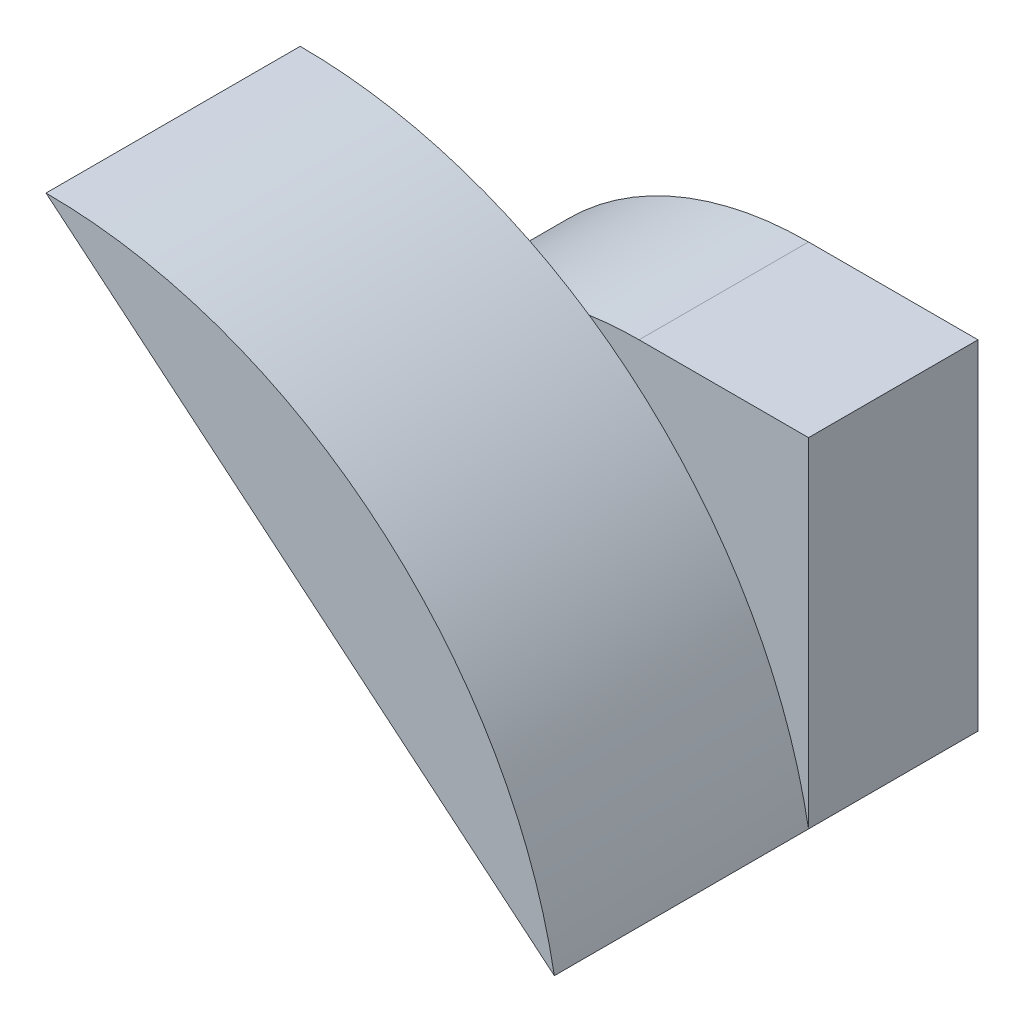
ISO-10303-21;
HEADER;
FILE_DESCRIPTION(('STEP AP214'),'2;1');
FILE_NAME('part.step','',(''),(''),'','','');
FILE_SCHEMA(('AUTOMOTIVE_DESIGN { 1 0 10303 214 1 1 1 1 }'));
ENDSEC;
DATA;
#1=APPLICATION_CONTEXT('core data for automotive mechanical design processes');
#2=APPLICATION_PROTOCOL_DEFINITION('international standard','automotive_design',2000,#1);
#3=PRODUCT_CONTEXT('',#1,'mechanical');
#4=PRODUCT('Part','Part','',(#3));
#5=PRODUCT_RELATED_PRODUCT_CATEGORY('part','',(#4));
#6=PRODUCT_DEFINITION_FORMATION('','',#4);
#7=PRODUCT_DEFINITION_CONTEXT('part definition',#1,'design');
#8=PRODUCT_DEFINITION('design','',#6,#7);
#9=PRODUCT_DEFINITION_SHAPE('','',#8);
#10=(LENGTH_UNIT() NAMED_UNIT(*) SI_UNIT(.MILLI.,.METRE.));
#11=(NAMED_UNIT(*) PLANE_ANGLE_UNIT() SI_UNIT($,.RADIAN.));
#12=(NAMED_UNIT(*) SI_UNIT($,.STERADIAN.) SOLID_ANGLE_UNIT());
#13=UNCERTAINTY_MEASURE_WITH_UNIT(LENGTH_MEASURE(1.E-05),#10,'distance_accuracy_value','');
#14=(GEOMETRIC_REPRESENTATION_CONTEXT(3) GLOBAL_UNCERTAINTY_ASSIGNED_CONTEXT((#13)) GLOBAL_UNIT_ASSIGNED_CONTEXT((#10,
#11,#12)) REPRESENTATION_CONTEXT('',''));
#15=CARTESIAN_POINT('',(0.,0.,0.));
#16=DIRECTION('',(0.,0.,1.));
#17=DIRECTION('',(1.,0.,0.));
#18=AXIS2_PLACEMENT_3D('',#15,#16,#17);
#19=CARTESIAN_POINT('',(-9.99999999999999,0.,10.));
#20=DIRECTION('',(0.,0.,1.));
#21=DIRECTION('',(1.,0.,0.));
#22=AXIS2_PLACEMENT_3D('',#19,#20,#21);
#23=PLANE('',#22);
#24=CARTESIAN_POINT('',(-30.,-5.5,10.));
#25=DIRECTION('',(0.,0.,1.));
#26=DIRECTION('',(-1.,0.,0.));
#27=AXIS2_PLACEMENT_3D('',#24,#25,#26);
#28=CIRCLE('',#27,30.5);
#29=CARTESIAN_POINT('',(0.,0.,10.));
#30=VERTEX_POINT('',#29);
#31=CARTESIAN_POINT('',(-12.9402408623292,19.7826940448335,10.));
#32=VERTEX_POINT('',#31);
#33=EDGE_CURVE('E159',#30,#32,#28,.T.);
#34=ORIENTED_EDGE('',*,*,#33,.F.);
#35=DIRECTION('',(0.,1.,0.));
#36=VECTOR('',#35,1.);
#37=CARTESIAN_POINT('',(0.,0.,10.));
#38=LINE('',#37,#36);
#39=CARTESIAN_POINT('',(0.,20.,10.));
#40=VERTEX_POINT('',#39);
#41=EDGE_CURVE('E123',#30,#40,#38,.T.);
#42=ORIENTED_EDGE('',*,*,#41,.T.);
#43=DIRECTION('',(-1.,0.,0.));
#44=VECTOR('',#43,1.);
#45=CARTESIAN_POINT('',(0.,20.,10.));
#46=LINE('',#45,#44);
#47=CARTESIAN_POINT('',(-10.,20.,10.));
#48=VERTEX_POINT('',#47);
#49=EDGE_CURVE('E125',#40,#48,#46,.T.);
#50=ORIENTED_EDGE('',*,*,#49,.T.);
#51=CARTESIAN_POINT('',(-9.99999999999999,0.,10.));
#52=DIRECTION('',(0.,0.,1.));
#53=DIRECTION('',(1.,0.,0.));
#54=AXIS2_PLACEMENT_3D('',#51,#52,#53);
#55=CIRCLE('',#54,20.);
#56=EDGE_CURVE('E118',#48,#32,#55,.T.);
#57=ORIENTED_EDGE('',*,*,#56,.T.);
#58=EDGE_LOOP('',(#34,#42,#50,#57));
#59=FACE_BOUND('',#58,.T.);
#60=ADVANCED_FACE('F33',(#59),#23,.T.);
#61=CARTESIAN_POINT('',(-9.99999999999999,0.,10.));
#62=DIRECTION('',(0.,0.,-1.));
#63=DIRECTION('',(-1.,0.,0.));
#64=AXIS2_PLACEMENT_3D('',#61,#62,#63);
#65=CYLINDRICAL_SURFACE('',#64,20.);
#66=CARTESIAN_POINT('',(-9.99999999999999,0.,0.));
#67=DIRECTION('',(0.,0.,1.));
#68=DIRECTION('',(1.,0.,0.));
#69=AXIS2_PLACEMENT_3D('',#66,#67,#68);
#70=CIRCLE('',#69,20.);
#71=CARTESIAN_POINT('',(-10.,20.,0.));
#72=VERTEX_POINT('',#71);
#73=CARTESIAN_POINT('',(-30.,0.,0.));
#74=VERTEX_POINT('',#73);
#75=EDGE_CURVE('E111',#72,#74,#70,.T.);
#76=ORIENTED_EDGE('',*,*,#75,.T.);
#77=DIRECTION('',(0.,0.,-1.));
#78=VECTOR('',#77,1.);
#79=CARTESIAN_POINT('',(-30.,0.,10.));
#80=LINE('',#79,#78);
#81=CARTESIAN_POINT('',(-30.,0.,10.));
#82=VERTEX_POINT('',#81);
#83=EDGE_CURVE('E37',#82,#74,#80,.T.);
#84=ORIENTED_EDGE('',*,*,#83,.F.);
#85=CARTESIAN_POINT('',(-20.4576871347037,17.0480726122531,10.));
#86=VERTEX_POINT('',#85);
#87=EDGE_CURVE('E121',#86,#82,#55,.T.);
#88=ORIENTED_EDGE('',*,*,#87,.F.);
#89=EDGE_CURVE('E55',#32,#86,#55,.T.);
#90=ORIENTED_EDGE('',*,*,#89,.F.);
#91=ORIENTED_EDGE('',*,*,#56,.F.);
#92=DIRECTION('',(0.,0.,-1.));
#93=VECTOR('',#92,1.);
#94=CARTESIAN_POINT('',(-10.,20.,10.));
#95=LINE('',#94,#93);
#96=EDGE_CURVE('E126',#48,#72,#95,.T.);
#97=ORIENTED_EDGE('',*,*,#96,.T.);
#98=EDGE_LOOP('',(#76,#84,#88,#90,#91,#97));
#99=FACE_BOUND('',#98,.T.);
#100=ADVANCED_FACE('F35',(#99),#65,.T.);
#101=CARTESIAN_POINT('',(-30.,0.,10.));
#102=DIRECTION('',(0.,1.,0.));
#103=DIRECTION('',(0.,0.,1.));
#104=AXIS2_PLACEMENT_3D('',#101,#102,#103);
#105=PLANE('',#104);
#106=DIRECTION('',(1.,0.,0.));
#107=VECTOR('',#106,1.);
#108=CARTESIAN_POINT('',(-30.,0.,0.));
#109=LINE('',#108,#107);
#110=CARTESIAN_POINT('',(0.,0.,0.));
#111=VERTEX_POINT('',#110);
#112=EDGE_CURVE('E114',#74,#111,#109,.T.);
#113=ORIENTED_EDGE('',*,*,#112,.T.);
#114=DIRECTION('',(0.,0.,-1.));
#115=VECTOR('',#114,1.);
#116=CARTESIAN_POINT('',(0.,0.,10.));
#117=LINE('',#116,#115);
#118=EDGE_CURVE('E137',#30,#111,#117,.T.);
#119=ORIENTED_EDGE('',*,*,#118,.F.);
#120=DIRECTION('',(1.,0.,0.));
#121=VECTOR('',#120,1.);
#122=CARTESIAN_POINT('',(-30.,0.,10.));
#123=LINE('',#122,#121);
#124=EDGE_CURVE('E120',#82,#30,#123,.T.);
#125=ORIENTED_EDGE('',*,*,#124,.F.);
#126=ORIENTED_EDGE('',*,*,#83,.T.);
#127=EDGE_LOOP('',(#113,#119,#125,#126));
#128=FACE_BOUND('',#127,.T.);
#129=ADVANCED_FACE('F146',(#128),#105,.F.);
#130=CARTESIAN_POINT('',(0.,0.,10.));
#131=DIRECTION('',(-1.,0.,0.));
#132=DIRECTION('',(0.,0.,1.));
#133=AXIS2_PLACEMENT_3D('',#130,#131,#132);
#134=PLANE('',#133);
#135=DIRECTION('',(0.,1.,0.));
#136=VECTOR('',#135,1.);
#137=CARTESIAN_POINT('',(0.,0.,0.));
#138=LINE('',#137,#136);
#139=CARTESIAN_POINT('',(0.,20.,0.));
#140=VERTEX_POINT('',#139);
#141=EDGE_CURVE('E129',#111,#140,#138,.T.);
#142=ORIENTED_EDGE('',*,*,#141,.T.);
#143=DIRECTION('',(0.,0.,-1.));
#144=VECTOR('',#143,1.);
#145=CARTESIAN_POINT('',(0.,20.,10.));
#146=LINE('',#145,#144);
#147=EDGE_CURVE('E135',#40,#140,#146,.T.);
#148=ORIENTED_EDGE('',*,*,#147,.F.);
#149=ORIENTED_EDGE('',*,*,#41,.F.);
#150=ORIENTED_EDGE('',*,*,#118,.T.);
#151=EDGE_LOOP('',(#142,#148,#149,#150));
#152=FACE_BOUND('',#151,.T.);
#153=ADVANCED_FACE('F153',(#152),#134,.F.);
#154=CARTESIAN_POINT('',(0.,20.,10.));
#155=DIRECTION('',(0.,-1.,0.));
#156=DIRECTION('',(1.,0.,0.));
#157=AXIS2_PLACEMENT_3D('',#154,#155,#156);
#158=PLANE('',#157);
#159=DIRECTION('',(-1.,0.,0.));
#160=VECTOR('',#159,1.);
#161=CARTESIAN_POINT('',(0.,20.,0.));
#162=LINE('',#161,#160);
#163=EDGE_CURVE('E131',#140,#72,#162,.T.);
#164=ORIENTED_EDGE('',*,*,#163,.T.);
#165=ORIENTED_EDGE('',*,*,#96,.F.);
#166=ORIENTED_EDGE('',*,*,#49,.F.);
#167=ORIENTED_EDGE('',*,*,#147,.T.);
#168=EDGE_LOOP('',(#164,#165,#166,#167));
#169=FACE_BOUND('',#168,.T.);
#170=ADVANCED_FACE('F156',(#169),#158,.F.);
#171=DIRECTION('',(0.768221279597376,-0.64018439966448,0.));
#172=VECTOR('',#171,1.);
#173=CARTESIAN_POINT('',(0.,0.,10.));
#174=LINE('',#173,#172);
#175=EDGE_CURVE('E11',#86,#30,#174,.T.);
#176=ORIENTED_EDGE('',*,*,#175,.F.);
#177=ORIENTED_EDGE('',*,*,#87,.T.);
#178=ORIENTED_EDGE('',*,*,#124,.T.);
#179=EDGE_LOOP('',(#176,#177,#178));
#180=FACE_BOUND('',#179,.T.);
#181=ADVANCED_FACE('F160',(#180),#23,.T.);
#182=CARTESIAN_POINT('',(-9.99999999999999,0.,0.));
#183=DIRECTION('',(0.,0.,1.));
#184=DIRECTION('',(1.,0.,0.));
#185=AXIS2_PLACEMENT_3D('',#182,#183,#184);
#186=PLANE('',#185);
#187=ORIENTED_EDGE('',*,*,#75,.F.);
#188=ORIENTED_EDGE('',*,*,#163,.F.);
#189=ORIENTED_EDGE('',*,*,#141,.F.);
#190=ORIENTED_EDGE('',*,*,#112,.F.);
#191=EDGE_LOOP('',(#187,#188,#189,#190));
#192=FACE_BOUND('',#191,.T.);
#193=ADVANCED_FACE('F151',(#192),#186,.F.);
#194=CARTESIAN_POINT('',(-30.,-5.5,25.));
#195=DIRECTION('',(0.,0.,-1.));
#196=DIRECTION('',(-1.,0.,0.));
#197=AXIS2_PLACEMENT_3D('',#194,#195,#196);
#198=CYLINDRICAL_SURFACE('',#197,30.5);
#199=ORIENTED_EDGE('',*,*,#33,.T.);
#200=CARTESIAN_POINT('',(-30.,25.,10.));
#201=VERTEX_POINT('',#200);
#202=EDGE_CURVE('E109',#32,#201,#28,.T.);
#203=ORIENTED_EDGE('',*,*,#202,.T.);
#204=DIRECTION('',(0.,0.,-1.));
#205=VECTOR('',#204,1.);
#206=CARTESIAN_POINT('',(-30.,25.,25.));
#207=LINE('',#206,#205);
#208=CARTESIAN_POINT('',(-30.,25.,25.));
#209=VERTEX_POINT('',#208);
#210=EDGE_CURVE('E96',#209,#201,#207,.T.);
#211=ORIENTED_EDGE('',*,*,#210,.F.);
#212=CARTESIAN_POINT('',(-30.,-5.5,25.));
#213=DIRECTION('',(0.,0.,1.));
#214=DIRECTION('',(-1.,0.,0.));
#215=AXIS2_PLACEMENT_3D('',#212,#213,#214);
#216=CIRCLE('',#215,30.5);
#217=CARTESIAN_POINT('',(0.,0.,25.));
#218=VERTEX_POINT('',#217);
#219=EDGE_CURVE('E101',#218,#209,#216,.T.);
#220=ORIENTED_EDGE('',*,*,#219,.F.);
#221=DIRECTION('',(0.,0.,-1.));
#222=VECTOR('',#221,1.);
#223=CARTESIAN_POINT('',(0.,0.,25.));
#224=LINE('',#223,#222);
#225=EDGE_CURVE('E98',#218,#30,#224,.T.);
#226=ORIENTED_EDGE('',*,*,#225,.T.);
#227=EDGE_LOOP('',(#199,#203,#211,#220,#226));
#228=FACE_BOUND('',#227,.T.);
#229=ADVANCED_FACE('F107',(#228),#198,.T.);
#230=CARTESIAN_POINT('',(0.,0.,25.));
#231=DIRECTION('',(0.64018439966448,0.768221279597376,0.));
#232=DIRECTION('',(-0.768221279597376,0.64018439966448,0.));
#233=AXIS2_PLACEMENT_3D('',#230,#231,#232);
#234=PLANE('',#233);
#235=EDGE_CURVE('E43',#201,#86,#174,.T.);
#236=ORIENTED_EDGE('',*,*,#235,.T.);
#237=ORIENTED_EDGE('',*,*,#175,.T.);
#238=ORIENTED_EDGE('',*,*,#225,.F.);
#239=DIRECTION('',(0.768221279597376,-0.64018439966448,0.));
#240=VECTOR('',#239,1.);
#241=CARTESIAN_POINT('',(0.,0.,25.));
#242=LINE('',#241,#240);
#243=EDGE_CURVE('E91',#209,#218,#242,.T.);
#244=ORIENTED_EDGE('',*,*,#243,.F.);
#245=ORIENTED_EDGE('',*,*,#210,.T.);
#246=EDGE_LOOP('',(#236,#237,#238,#244,#245));
#247=FACE_BOUND('',#246,.T.);
#248=ADVANCED_FACE('F94',(#247),#234,.F.);
#249=CARTESIAN_POINT('',(-30.,-5.5,25.));
#250=DIRECTION('',(0.,0.,-1.));
#251=DIRECTION('',(-1.,0.,0.));
#252=AXIS2_PLACEMENT_3D('',#249,#250,#251);
#253=PLANE('',#252);
#254=ORIENTED_EDGE('',*,*,#219,.T.);
#255=ORIENTED_EDGE('',*,*,#243,.T.);
#256=EDGE_LOOP('',(#254,#255));
#257=FACE_BOUND('',#256,.T.);
#258=ADVANCED_FACE('F103',(#257),#253,.F.);
#259=CARTESIAN_POINT('',(-30.,-5.5,10.));
#260=DIRECTION('',(0.,0.,-1.));
#261=DIRECTION('',(-1.,0.,0.));
#262=AXIS2_PLACEMENT_3D('',#259,#260,#261);
#263=PLANE('',#262);
#264=ORIENTED_EDGE('',*,*,#202,.F.);
#265=ORIENTED_EDGE('',*,*,#89,.T.);
#266=ORIENTED_EDGE('',*,*,#235,.F.);
#267=EDGE_LOOP('',(#264,#265,#266));
#268=FACE_BOUND('',#267,.T.);
#269=ADVANCED_FACE('F162',(#268),#263,.T.);
#270=CLOSED_SHELL('',(#60,#100,#129,#153,#170,#181,#193,#229,#248,#258,#269));
#271=MANIFOLD_SOLID_BREP('B2',#270);
#272=ADVANCED_BREP_SHAPE_REPRESENTATION('',(#18,#271),#14);
#273=SHAPE_DEFINITION_REPRESENTATION(#9,#272);
ENDSEC;
END-ISO-10303-21;
